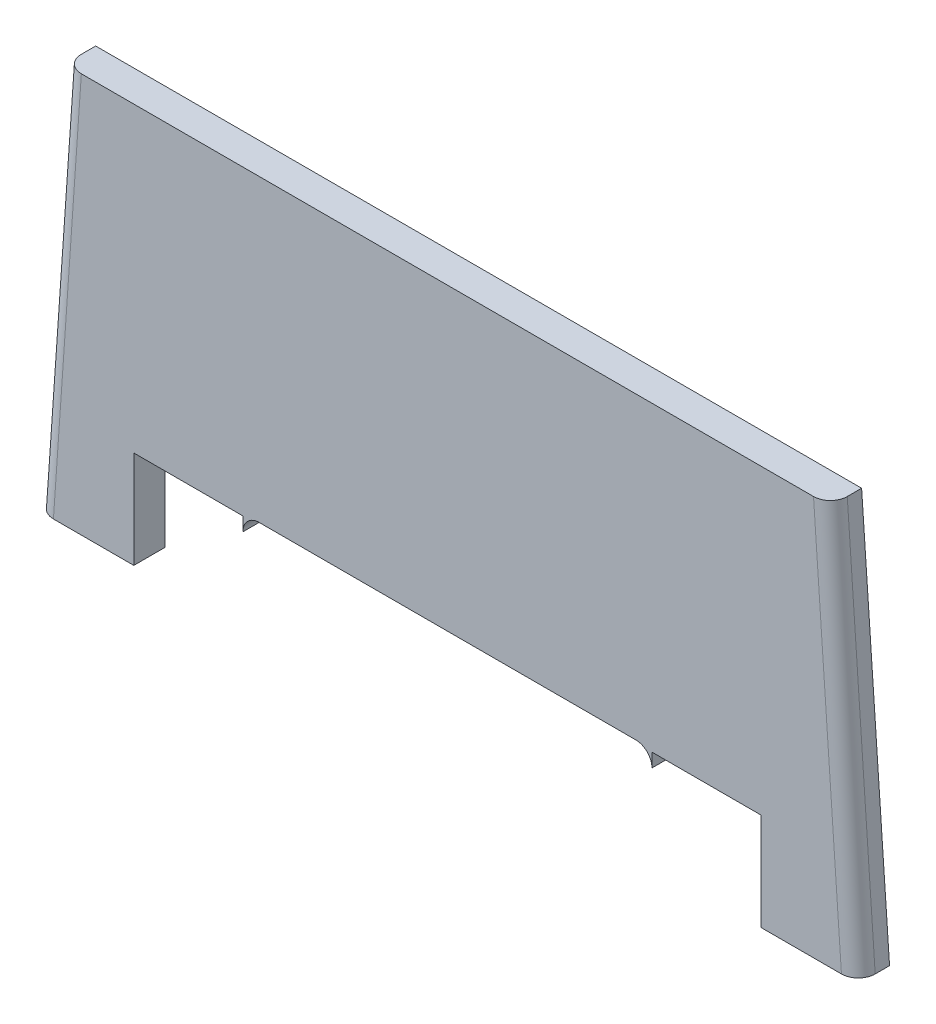
ISO-10303-21;
HEADER;
FILE_DESCRIPTION(('STEP AP214'),'2;1');
FILE_NAME('part.step','',(''),(''),'','','');
FILE_SCHEMA(('AUTOMOTIVE_DESIGN { 1 0 10303 214 1 1 1 1 }'));
ENDSEC;
DATA;
#1=APPLICATION_CONTEXT('core data for automotive mechanical design processes');
#2=APPLICATION_PROTOCOL_DEFINITION('international standard','automotive_design',2000,#1);
#3=PRODUCT_CONTEXT('',#1,'mechanical');
#4=PRODUCT('Part','Part','',(#3));
#5=PRODUCT_RELATED_PRODUCT_CATEGORY('part','',(#4));
#6=PRODUCT_DEFINITION_FORMATION('','',#4);
#7=PRODUCT_DEFINITION_CONTEXT('part definition',#1,'design');
#8=PRODUCT_DEFINITION('design','',#6,#7);
#9=PRODUCT_DEFINITION_SHAPE('','',#8);
#10=(LENGTH_UNIT() NAMED_UNIT(*) SI_UNIT(.MILLI.,.METRE.));
#11=(NAMED_UNIT(*) PLANE_ANGLE_UNIT() SI_UNIT($,.RADIAN.));
#12=(NAMED_UNIT(*) SI_UNIT($,.STERADIAN.) SOLID_ANGLE_UNIT());
#13=UNCERTAINTY_MEASURE_WITH_UNIT(LENGTH_MEASURE(1.E-05),#10,'distance_accuracy_value','');
#14=(GEOMETRIC_REPRESENTATION_CONTEXT(3) GLOBAL_UNCERTAINTY_ASSIGNED_CONTEXT((#13)) GLOBAL_UNIT_ASSIGNED_CONTEXT((#10,
#11,#12)) REPRESENTATION_CONTEXT('',''));
#15=CARTESIAN_POINT('',(0.,0.,0.));
#16=DIRECTION('',(0.,0.,1.));
#17=DIRECTION('',(1.,0.,0.));
#18=AXIS2_PLACEMENT_3D('',#15,#16,#17);
#19=CARTESIAN_POINT('',(-251.2,-80.,25.));
#20=DIRECTION('',(0.,-1.,0.));
#21=DIRECTION('',(1.,0.,0.));
#22=AXIS2_PLACEMENT_3D('',#19,#20,#21);
#23=PLANE('',#22);
#24=DIRECTION('',(-1.,0.,0.));
#25=VECTOR('',#24,1.);
#26=CARTESIAN_POINT('',(-251.2,-80.,25.));
#27=LINE('',#26,#25);
#28=CARTESIAN_POINT('',(-251.2,-80.,25.));
#29=VERTEX_POINT('',#28);
#30=CARTESIAN_POINT('',(-315.567034375904,-80.,25.));
#31=VERTEX_POINT('',#30);
#32=EDGE_CURVE('E188',#29,#31,#27,.T.);
#33=ORIENTED_EDGE('',*,*,#32,.T.);
#34=CARTESIAN_POINT('',(-315.567034375904,-80.,11.5));
#35=DIRECTION('',(0.,-1.,0.));
#36=DIRECTION('',(1.,0.,0.));
#37=AXIS2_PLACEMENT_3D('',#34,#35,#36);
#38=ELLIPSE('',#37,13.5329656240958,13.5);
#39=CARTESIAN_POINT('',(-329.1,-80.,11.5));
#40=VERTEX_POINT('',#39);
#41=EDGE_CURVE('E11',#31,#40,#38,.T.);
#42=ORIENTED_EDGE('',*,*,#41,.T.);
#43=DIRECTION('',(0.,0.,-1.));
#44=VECTOR('',#43,1.);
#45=CARTESIAN_POINT('',(-329.1,-80.,25.));
#46=LINE('',#45,#44);
#47=CARTESIAN_POINT('',(-329.1,-80.,0.));
#48=VERTEX_POINT('',#47);
#49=EDGE_CURVE('E219',#40,#48,#46,.T.);
#50=ORIENTED_EDGE('',*,*,#49,.T.);
#51=DIRECTION('',(-1.,0.,0.));
#52=VECTOR('',#51,1.);
#53=CARTESIAN_POINT('',(-251.2,-80.,0.));
#54=LINE('',#53,#52);
#55=CARTESIAN_POINT('',(-251.2,-80.,0.));
#56=VERTEX_POINT('',#55);
#57=EDGE_CURVE('E220',#56,#48,#54,.T.);
#58=ORIENTED_EDGE('',*,*,#57,.F.);
#59=DIRECTION('',(0.,0.,-1.));
#60=VECTOR('',#59,1.);
#61=CARTESIAN_POINT('',(-251.2,-80.,25.));
#62=LINE('',#61,#60);
#63=EDGE_CURVE('E270',#29,#56,#62,.T.);
#64=ORIENTED_EDGE('',*,*,#63,.F.);
#65=EDGE_LOOP('',(#33,#42,#50,#58,#64));
#66=FACE_BOUND('',#65,.T.);
#67=ADVANCED_FACE('F39',(#66),#23,.T.);
#68=CARTESIAN_POINT('',(-251.2,-2.,25.));
#69=DIRECTION('',(1.,0.,0.));
#70=DIRECTION('',(0.,0.,-1.));
#71=AXIS2_PLACEMENT_3D('',#68,#69,#70);
#72=PLANE('',#71);
#73=DIRECTION('',(0.,-1.,0.));
#74=VECTOR('',#73,1.);
#75=CARTESIAN_POINT('',(-251.2,-2.,0.));
#76=LINE('',#75,#74);
#77=CARTESIAN_POINT('',(-251.2,-2.,0.));
#78=VERTEX_POINT('',#77);
#79=EDGE_CURVE('E266',#78,#56,#76,.T.);
#80=ORIENTED_EDGE('',*,*,#79,.F.);
#81=DIRECTION('',(0.,0.,-1.));
#82=VECTOR('',#81,1.);
#83=CARTESIAN_POINT('',(-251.2,-2.,25.));
#84=LINE('',#83,#82);
#85=CARTESIAN_POINT('',(-251.2,-2.,25.));
#86=VERTEX_POINT('',#85);
#87=EDGE_CURVE('E274',#86,#78,#84,.T.);
#88=ORIENTED_EDGE('',*,*,#87,.F.);
#89=DIRECTION('',(0.,-1.,0.));
#90=VECTOR('',#89,1.);
#91=CARTESIAN_POINT('',(-251.2,-2.,25.));
#92=LINE('',#91,#90);
#93=EDGE_CURVE('E215',#86,#29,#92,.T.);
#94=ORIENTED_EDGE('',*,*,#93,.T.);
#95=ORIENTED_EDGE('',*,*,#63,.T.);
#96=EDGE_LOOP('',(#80,#88,#94,#95));
#97=FACE_BOUND('',#96,.T.);
#98=ADVANCED_FACE('F346',(#97),#72,.T.);
#99=CARTESIAN_POINT('',(-163.8,-1.99999999999999,25.));
#100=DIRECTION('',(0.,-1.,0.));
#101=DIRECTION('',(1.,0.,0.));
#102=AXIS2_PLACEMENT_3D('',#99,#100,#101);
#103=PLANE('',#102);
#104=DIRECTION('',(-1.,0.,0.));
#105=VECTOR('',#104,1.);
#106=CARTESIAN_POINT('',(-163.8,-1.99999999999999,0.));
#107=LINE('',#106,#105);
#108=CARTESIAN_POINT('',(-163.8,-1.99999999999999,0.));
#109=VERTEX_POINT('',#108);
#110=EDGE_CURVE('E262',#109,#78,#107,.T.);
#111=ORIENTED_EDGE('',*,*,#110,.F.);
#112=DIRECTION('',(0.,0.,-1.));
#113=VECTOR('',#112,1.);
#114=CARTESIAN_POINT('',(-163.8,-1.99999999999999,25.));
#115=LINE('',#114,#113);
#116=CARTESIAN_POINT('',(-163.8,-1.99999999999999,25.));
#117=VERTEX_POINT('',#116);
#118=EDGE_CURVE('E277',#117,#109,#115,.T.);
#119=ORIENTED_EDGE('',*,*,#118,.F.);
#120=DIRECTION('',(-1.,0.,0.));
#121=VECTOR('',#120,1.);
#122=CARTESIAN_POINT('',(-163.8,-1.99999999999999,25.));
#123=LINE('',#122,#121);
#124=EDGE_CURVE('E211',#117,#86,#123,.T.);
#125=ORIENTED_EDGE('',*,*,#124,.T.);
#126=ORIENTED_EDGE('',*,*,#87,.T.);
#127=EDGE_LOOP('',(#111,#119,#125,#126));
#128=FACE_BOUND('',#127,.T.);
#129=ADVANCED_FACE('F349',(#128),#103,.T.);
#130=CARTESIAN_POINT('',(-163.8,-1.99999999999999,25.));
#131=DIRECTION('',(1.,0.,0.));
#132=DIRECTION('',(0.,1.,0.));
#133=AXIS2_PLACEMENT_3D('',#130,#131,#132);
#134=PLANE('',#133);
#135=DIRECTION('',(0.,-1.,0.));
#136=VECTOR('',#135,1.);
#137=CARTESIAN_POINT('',(-163.8,-1.99999999999999,0.));
#138=LINE('',#137,#136);
#139=CARTESIAN_POINT('',(-163.8,-13.,0.));
#140=VERTEX_POINT('',#139);
#141=EDGE_CURVE('E259',#109,#140,#138,.T.);
#142=ORIENTED_EDGE('',*,*,#141,.T.);
#143=DIRECTION('',(0.,0.,-1.));
#144=VECTOR('',#143,1.);
#145=CARTESIAN_POINT('',(-163.8,-13.,25.));
#146=LINE('',#145,#144);
#147=CARTESIAN_POINT('',(-163.8,-13.,25.));
#148=VERTEX_POINT('',#147);
#149=EDGE_CURVE('E280',#148,#140,#146,.T.);
#150=ORIENTED_EDGE('',*,*,#149,.F.);
#151=DIRECTION('',(0.,-1.,0.));
#152=VECTOR('',#151,1.);
#153=CARTESIAN_POINT('',(-163.8,-1.99999999999999,25.));
#154=LINE('',#153,#152);
#155=EDGE_CURVE('E208',#117,#148,#154,.T.);
#156=ORIENTED_EDGE('',*,*,#155,.F.);
#157=ORIENTED_EDGE('',*,*,#118,.T.);
#158=EDGE_LOOP('',(#142,#150,#156,#157));
#159=FACE_BOUND('',#158,.T.);
#160=ADVANCED_FACE('F355',(#159),#134,.F.);
#161=CARTESIAN_POINT('',(-150.8,-13.,25.));
#162=DIRECTION('',(0.,0.,-1.));
#163=DIRECTION('',(-1.,0.,0.));
#164=AXIS2_PLACEMENT_3D('',#161,#162,#163);
#165=CYLINDRICAL_SURFACE('',#164,13.);
#166=CARTESIAN_POINT('',(-150.8,-13.,0.));
#167=DIRECTION('',(0.,0.,-1.));
#168=DIRECTION('',(-1.,0.,0.));
#169=AXIS2_PLACEMENT_3D('',#166,#167,#168);
#170=CIRCLE('',#169,13.);
#171=CARTESIAN_POINT('',(-150.8,0.,0.));
#172=VERTEX_POINT('',#171);
#173=EDGE_CURVE('E256',#140,#172,#170,.T.);
#174=ORIENTED_EDGE('',*,*,#173,.T.);
#175=DIRECTION('',(0.,0.,-1.));
#176=VECTOR('',#175,1.);
#177=CARTESIAN_POINT('',(-150.8,0.,25.));
#178=LINE('',#177,#176);
#179=CARTESIAN_POINT('',(-150.8,0.,25.));
#180=VERTEX_POINT('',#179);
#181=EDGE_CURVE('E284',#180,#172,#178,.T.);
#182=ORIENTED_EDGE('',*,*,#181,.F.);
#183=CARTESIAN_POINT('',(-150.8,-13.,25.));
#184=DIRECTION('',(0.,0.,-1.));
#185=DIRECTION('',(-1.,0.,0.));
#186=AXIS2_PLACEMENT_3D('',#183,#184,#185);
#187=CIRCLE('',#186,13.);
#188=EDGE_CURVE('E205',#148,#180,#187,.T.);
#189=ORIENTED_EDGE('',*,*,#188,.F.);
#190=ORIENTED_EDGE('',*,*,#149,.T.);
#191=EDGE_LOOP('',(#174,#182,#189,#190));
#192=FACE_BOUND('',#191,.T.);
#193=ADVANCED_FACE('F359',(#192),#165,.F.);
#194=CARTESIAN_POINT('',(-150.8,0.,25.));
#195=DIRECTION('',(0.,1.,0.));
#196=DIRECTION('',(-1.,0.,0.));
#197=AXIS2_PLACEMENT_3D('',#194,#195,#196);
#198=PLANE('',#197);
#199=DIRECTION('',(1.,0.,0.));
#200=VECTOR('',#199,1.);
#201=CARTESIAN_POINT('',(-150.8,0.,0.));
#202=LINE('',#201,#200);
#203=CARTESIAN_POINT('',(150.8,0.,0.));
#204=VERTEX_POINT('',#203);
#205=EDGE_CURVE('E252',#172,#204,#202,.T.);
#206=ORIENTED_EDGE('',*,*,#205,.T.);
#207=DIRECTION('',(0.,0.,-1.));
#208=VECTOR('',#207,1.);
#209=CARTESIAN_POINT('',(150.8,0.,25.));
#210=LINE('',#209,#208);
#211=CARTESIAN_POINT('',(150.8,0.,25.));
#212=VERTEX_POINT('',#211);
#213=EDGE_CURVE('E288',#212,#204,#210,.T.);
#214=ORIENTED_EDGE('',*,*,#213,.F.);
#215=DIRECTION('',(1.,0.,0.));
#216=VECTOR('',#215,1.);
#217=CARTESIAN_POINT('',(-150.8,0.,25.));
#218=LINE('',#217,#216);
#219=EDGE_CURVE('E202',#180,#212,#218,.T.);
#220=ORIENTED_EDGE('',*,*,#219,.F.);
#221=ORIENTED_EDGE('',*,*,#181,.T.);
#222=EDGE_LOOP('',(#206,#214,#220,#221));
#223=FACE_BOUND('',#222,.T.);
#224=ADVANCED_FACE('F364',(#223),#198,.F.);
#225=CARTESIAN_POINT('',(150.8,-13.,25.));
#226=DIRECTION('',(0.,0.,-1.));
#227=DIRECTION('',(-1.,0.,0.));
#228=AXIS2_PLACEMENT_3D('',#225,#226,#227);
#229=CYLINDRICAL_SURFACE('',#228,13.);
#230=CARTESIAN_POINT('',(150.8,-13.,0.));
#231=DIRECTION('',(0.,0.,1.));
#232=DIRECTION('',(1.,0.,0.));
#233=AXIS2_PLACEMENT_3D('',#230,#231,#232);
#234=CIRCLE('',#233,13.);
#235=CARTESIAN_POINT('',(163.8,-13.,0.));
#236=VERTEX_POINT('',#235);
#237=EDGE_CURVE('E248',#236,#204,#234,.T.);
#238=ORIENTED_EDGE('',*,*,#237,.F.);
#239=DIRECTION('',(0.,0.,-1.));
#240=VECTOR('',#239,1.);
#241=CARTESIAN_POINT('',(163.8,-13.,25.));
#242=LINE('',#241,#240);
#243=CARTESIAN_POINT('',(163.8,-13.,25.));
#244=VERTEX_POINT('',#243);
#245=EDGE_CURVE('E291',#244,#236,#242,.T.);
#246=ORIENTED_EDGE('',*,*,#245,.F.);
#247=CARTESIAN_POINT('',(150.8,-13.,25.));
#248=DIRECTION('',(0.,0.,1.));
#249=DIRECTION('',(1.,0.,0.));
#250=AXIS2_PLACEMENT_3D('',#247,#248,#249);
#251=CIRCLE('',#250,13.);
#252=EDGE_CURVE('E198',#244,#212,#251,.T.);
#253=ORIENTED_EDGE('',*,*,#252,.T.);
#254=ORIENTED_EDGE('',*,*,#213,.T.);
#255=EDGE_LOOP('',(#238,#246,#253,#254));
#256=FACE_BOUND('',#255,.T.);
#257=ADVANCED_FACE('F411',(#256),#229,.F.);
#258=CARTESIAN_POINT('',(163.8,-1.99999999999995,25.));
#259=DIRECTION('',(1.,0.,0.));
#260=DIRECTION('',(0.,1.,0.));
#261=AXIS2_PLACEMENT_3D('',#258,#259,#260);
#262=PLANE('',#261);
#263=DIRECTION('',(0.,-1.,0.));
#264=VECTOR('',#263,1.);
#265=CARTESIAN_POINT('',(163.8,-1.99999999999995,0.));
#266=LINE('',#265,#264);
#267=CARTESIAN_POINT('',(163.8,-1.99999999999995,0.));
#268=VERTEX_POINT('',#267);
#269=EDGE_CURVE('E244',#268,#236,#266,.T.);
#270=ORIENTED_EDGE('',*,*,#269,.F.);
#271=DIRECTION('',(0.,0.,-1.));
#272=VECTOR('',#271,1.);
#273=CARTESIAN_POINT('',(163.8,-1.99999999999995,25.));
#274=LINE('',#273,#272);
#275=CARTESIAN_POINT('',(163.8,-1.99999999999995,25.));
#276=VERTEX_POINT('',#275);
#277=EDGE_CURVE('E294',#276,#268,#274,.T.);
#278=ORIENTED_EDGE('',*,*,#277,.F.);
#279=DIRECTION('',(0.,-1.,0.));
#280=VECTOR('',#279,1.);
#281=CARTESIAN_POINT('',(163.8,-1.99999999999995,25.));
#282=LINE('',#281,#280);
#283=EDGE_CURVE('E194',#276,#244,#282,.T.);
#284=ORIENTED_EDGE('',*,*,#283,.T.);
#285=ORIENTED_EDGE('',*,*,#245,.T.);
#286=EDGE_LOOP('',(#270,#278,#284,#285));
#287=FACE_BOUND('',#286,.T.);
#288=ADVANCED_FACE('F369',(#287),#262,.T.);
#289=CARTESIAN_POINT('',(163.8,-1.99999999999995,25.));
#290=DIRECTION('',(0.,1.,0.));
#291=DIRECTION('',(-1.,0.,0.));
#292=AXIS2_PLACEMENT_3D('',#289,#290,#291);
#293=PLANE('',#292);
#294=DIRECTION('',(1.,0.,0.));
#295=VECTOR('',#294,1.);
#296=CARTESIAN_POINT('',(163.8,-1.99999999999995,0.));
#297=LINE('',#296,#295);
#298=CARTESIAN_POINT('',(251.2,-1.99999999999994,0.));
#299=VERTEX_POINT('',#298);
#300=EDGE_CURVE('E241',#268,#299,#297,.T.);
#301=ORIENTED_EDGE('',*,*,#300,.T.);
#302=DIRECTION('',(0.,0.,-1.));
#303=VECTOR('',#302,1.);
#304=CARTESIAN_POINT('',(251.2,-1.99999999999994,25.));
#305=LINE('',#304,#303);
#306=CARTESIAN_POINT('',(251.2,-1.99999999999994,25.));
#307=VERTEX_POINT('',#306);
#308=EDGE_CURVE('E177',#307,#299,#305,.T.);
#309=ORIENTED_EDGE('',*,*,#308,.F.);
#310=DIRECTION('',(1.,0.,0.));
#311=VECTOR('',#310,1.);
#312=CARTESIAN_POINT('',(163.8,-1.99999999999995,25.));
#313=LINE('',#312,#311);
#314=EDGE_CURVE('E162',#276,#307,#313,.T.);
#315=ORIENTED_EDGE('',*,*,#314,.F.);
#316=ORIENTED_EDGE('',*,*,#277,.T.);
#317=EDGE_LOOP('',(#301,#309,#315,#316));
#318=FACE_BOUND('',#317,.T.);
#319=ADVANCED_FACE('F373',(#318),#293,.F.);
#320=CARTESIAN_POINT('',(251.2,-1.99999999999994,25.));
#321=DIRECTION('',(1.,0.,0.));
#322=DIRECTION('',(0.,1.,0.));
#323=AXIS2_PLACEMENT_3D('',#320,#321,#322);
#324=PLANE('',#323);
#325=DIRECTION('',(0.,-1.,0.));
#326=VECTOR('',#325,1.);
#327=CARTESIAN_POINT('',(251.2,-1.99999999999994,0.));
#328=LINE('',#327,#326);
#329=CARTESIAN_POINT('',(251.2,-79.9999999999999,0.));
#330=VERTEX_POINT('',#329);
#331=EDGE_CURVE('E172',#299,#330,#328,.T.);
#332=ORIENTED_EDGE('',*,*,#331,.T.);
#333=DIRECTION('',(0.,0.,-1.));
#334=VECTOR('',#333,1.);
#335=CARTESIAN_POINT('',(251.2,-79.9999999999999,25.));
#336=LINE('',#335,#334);
#337=CARTESIAN_POINT('',(251.2,-79.9999999999999,25.));
#338=VERTEX_POINT('',#337);
#339=EDGE_CURVE('E169',#338,#330,#336,.T.);
#340=ORIENTED_EDGE('',*,*,#339,.F.);
#341=DIRECTION('',(0.,-1.,0.));
#342=VECTOR('',#341,1.);
#343=CARTESIAN_POINT('',(251.2,-1.99999999999994,25.));
#344=LINE('',#343,#342);
#345=EDGE_CURVE('E153',#307,#338,#344,.T.);
#346=ORIENTED_EDGE('',*,*,#345,.F.);
#347=ORIENTED_EDGE('',*,*,#308,.T.);
#348=EDGE_LOOP('',(#332,#340,#346,#347));
#349=FACE_BOUND('',#348,.T.);
#350=ADVANCED_FACE('F170',(#349),#324,.F.);
#351=CARTESIAN_POINT('',(251.2,-79.9999999999999,25.));
#352=DIRECTION('',(0.,1.,0.));
#353=DIRECTION('',(-1.,0.,0.));
#354=AXIS2_PLACEMENT_3D('',#351,#352,#353);
#355=PLANE('',#354);
#356=DIRECTION('',(0.,0.,-1.));
#357=VECTOR('',#356,1.);
#358=CARTESIAN_POINT('',(329.1,-79.9999999999999,25.));
#359=LINE('',#358,#357);
#360=CARTESIAN_POINT('',(329.1,-79.9999999999999,11.5));
#361=VERTEX_POINT('',#360);
#362=CARTESIAN_POINT('',(329.1,-79.9999999999999,0.));
#363=VERTEX_POINT('',#362);
#364=EDGE_CURVE('E178',#361,#363,#359,.T.);
#365=ORIENTED_EDGE('',*,*,#364,.F.);
#366=CARTESIAN_POINT('',(315.567034375904,-79.9999999999999,11.5));
#367=DIRECTION('',(0.,1.,0.));
#368=DIRECTION('',(1.,0.,0.));
#369=AXIS2_PLACEMENT_3D('',#366,#367,#368);
#370=ELLIPSE('',#369,13.5329656240958,13.5);
#371=CARTESIAN_POINT('',(315.567034375904,-79.9999999999999,25.));
#372=VERTEX_POINT('',#371);
#373=EDGE_CURVE('E182',#361,#372,#370,.F.);
#374=ORIENTED_EDGE('',*,*,#373,.T.);
#375=DIRECTION('',(1.,0.,0.));
#376=VECTOR('',#375,1.);
#377=CARTESIAN_POINT('',(251.2,-79.9999999999999,25.));
#378=LINE('',#377,#376);
#379=EDGE_CURVE('E158',#338,#372,#378,.T.);
#380=ORIENTED_EDGE('',*,*,#379,.F.);
#381=ORIENTED_EDGE('',*,*,#339,.T.);
#382=DIRECTION('',(1.,0.,0.));
#383=VECTOR('',#382,1.);
#384=CARTESIAN_POINT('',(251.2,-79.9999999999999,0.));
#385=LINE('',#384,#383);
#386=EDGE_CURVE('E236',#330,#363,#385,.T.);
#387=ORIENTED_EDGE('',*,*,#386,.T.);
#388=EDGE_LOOP('',(#365,#374,#380,#381,#387));
#389=FACE_BOUND('',#388,.T.);
#390=ADVANCED_FACE('F180',(#389),#355,.F.);
#391=CARTESIAN_POINT('',(329.1,-79.9999999999999,25.));
#392=DIRECTION('',(-0.997564050259824,-0.069756473744129,0.));
#393=DIRECTION('',(0.069756473744129,-0.997564050259824,0.));
#394=AXIS2_PLACEMENT_3D('',#391,#392,#393);
#395=PLANE('',#394);
#396=DIRECTION('',(0.,0.,-1.));
#397=VECTOR('',#396,1.);
#398=CARTESIAN_POINT('',(306.723420178076,240.,25.));
#399=LINE('',#398,#397);
#400=CARTESIAN_POINT('',(306.723420178076,240.,11.5));
#401=VERTEX_POINT('',#400);
#402=CARTESIAN_POINT('',(306.723420178076,240.,0.));
#403=VERTEX_POINT('',#402);
#404=EDGE_CURVE('E301',#401,#403,#399,.T.);
#405=ORIENTED_EDGE('',*,*,#404,.F.);
#406=DIRECTION('',(-0.069756473744129,0.997564050259824,0.));
#407=VECTOR('',#406,1.);
#408=CARTESIAN_POINT('',(329.1,-79.9999999999999,11.5));
#409=LINE('',#408,#407);
#410=EDGE_CURVE('E61',#401,#361,#409,.F.);
#411=ORIENTED_EDGE('',*,*,#410,.T.);
#412=ORIENTED_EDGE('',*,*,#364,.T.);
#413=DIRECTION('',(-0.069756473744129,0.997564050259824,0.));
#414=VECTOR('',#413,1.);
#415=CARTESIAN_POINT('',(329.1,-79.9999999999999,0.));
#416=LINE('',#415,#414);
#417=EDGE_CURVE('E232',#363,#403,#416,.T.);
#418=ORIENTED_EDGE('',*,*,#417,.T.);
#419=EDGE_LOOP('',(#405,#411,#412,#418));
#420=FACE_BOUND('',#419,.T.);
#421=ADVANCED_FACE('F376',(#420),#395,.F.);
#422=CARTESIAN_POINT('',(-306.723420178076,240.,25.));
#423=DIRECTION('',(0.,1.,0.));
#424=DIRECTION('',(-1.,0.,0.));
#425=AXIS2_PLACEMENT_3D('',#422,#423,#424);
#426=PLANE('',#425);
#427=DIRECTION('',(1.,0.,0.));
#428=VECTOR('',#427,1.);
#429=CARTESIAN_POINT('',(-306.723420178076,240.,25.));
#430=LINE('',#429,#428);
#431=CARTESIAN_POINT('',(-293.19045455398,240.,25.));
#432=VERTEX_POINT('',#431);
#433=CARTESIAN_POINT('',(293.19045455398,240.,25.));
#434=VERTEX_POINT('',#433);
#435=EDGE_CURVE('E184',#432,#434,#430,.T.);
#436=ORIENTED_EDGE('',*,*,#435,.T.);
#437=CARTESIAN_POINT('',(293.19045455398,240.,11.5));
#438=DIRECTION('',(0.,1.,0.));
#439=DIRECTION('',(1.,0.,0.));
#440=AXIS2_PLACEMENT_3D('',#437,#438,#439);
#441=ELLIPSE('',#440,13.5329656240958,13.5);
#442=EDGE_CURVE('E317',#434,#401,#441,.T.);
#443=ORIENTED_EDGE('',*,*,#442,.T.);
#444=ORIENTED_EDGE('',*,*,#404,.T.);
#445=DIRECTION('',(1.,0.,0.));
#446=VECTOR('',#445,1.);
#447=CARTESIAN_POINT('',(-306.723420178076,240.,0.));
#448=LINE('',#447,#446);
#449=CARTESIAN_POINT('',(-306.723420178076,240.,0.));
#450=VERTEX_POINT('',#449);
#451=EDGE_CURVE('E228',#450,#403,#448,.T.);
#452=ORIENTED_EDGE('',*,*,#451,.F.);
#453=DIRECTION('',(0.,0.,-1.));
#454=VECTOR('',#453,1.);
#455=CARTESIAN_POINT('',(-306.723420178076,240.,25.));
#456=LINE('',#455,#454);
#457=CARTESIAN_POINT('',(-306.723420178076,240.,11.5));
#458=VERTEX_POINT('',#457);
#459=EDGE_CURVE('E304',#458,#450,#456,.T.);
#460=ORIENTED_EDGE('',*,*,#459,.F.);
#461=CARTESIAN_POINT('',(-293.19045455398,240.,11.5));
#462=DIRECTION('',(0.,1.,0.));
#463=DIRECTION('',(1.,0.,0.));
#464=AXIS2_PLACEMENT_3D('',#461,#462,#463);
#465=ELLIPSE('',#464,13.5329656240958,13.5);
#466=EDGE_CURVE('E314',#458,#432,#465,.T.);
#467=ORIENTED_EDGE('',*,*,#466,.T.);
#468=EDGE_LOOP('',(#436,#443,#444,#452,#460,#467));
#469=FACE_BOUND('',#468,.T.);
#470=ADVANCED_FACE('F333',(#469),#426,.T.);
#471=CARTESIAN_POINT('',(-329.1,-80.,25.));
#472=DIRECTION('',(-0.997564050259824,0.0697564737441287,0.));
#473=DIRECTION('',(-0.0697564737441287,-0.997564050259824,0.));
#474=AXIS2_PLACEMENT_3D('',#471,#472,#473);
#475=PLANE('',#474);
#476=ORIENTED_EDGE('',*,*,#49,.F.);
#477=DIRECTION('',(0.0697564737441287,0.997564050259824,0.));
#478=VECTOR('',#477,1.);
#479=CARTESIAN_POINT('',(-329.1,-80.,11.5));
#480=LINE('',#479,#478);
#481=EDGE_CURVE('E48',#40,#458,#480,.T.);
#482=ORIENTED_EDGE('',*,*,#481,.T.);
#483=ORIENTED_EDGE('',*,*,#459,.T.);
#484=DIRECTION('',(0.0697564737441287,0.997564050259824,0.));
#485=VECTOR('',#484,1.);
#486=CARTESIAN_POINT('',(-329.1,-80.,0.));
#487=LINE('',#486,#485);
#488=EDGE_CURVE('E224',#48,#450,#487,.T.);
#489=ORIENTED_EDGE('',*,*,#488,.F.);
#490=EDGE_LOOP('',(#476,#482,#483,#489));
#491=FACE_BOUND('',#490,.T.);
#492=ADVANCED_FACE('F328',(#491),#475,.T.);
#493=CARTESIAN_POINT('',(150.8,-13.,25.));
#494=DIRECTION('',(0.,0.,1.));
#495=DIRECTION('',(1.,0.,0.));
#496=AXIS2_PLACEMENT_3D('',#493,#494,#495);
#497=PLANE('',#496);
#498=ORIENTED_EDGE('',*,*,#379,.T.);
#499=DIRECTION('',(-0.069756473744129,0.997564050259824,0.));
#500=VECTOR('',#499,1.);
#501=CARTESIAN_POINT('',(293.256305499568,239.058287604454,25.));
#502=LINE('',#501,#500);
#503=EDGE_CURVE('E311',#372,#434,#502,.T.);
#504=ORIENTED_EDGE('',*,*,#503,.T.);
#505=ORIENTED_EDGE('',*,*,#435,.F.);
#506=DIRECTION('',(0.0697564737441287,0.997564050259824,0.));
#507=VECTOR('',#506,1.);
#508=CARTESIAN_POINT('',(-308.635409533869,19.1268534826662,25.));
#509=LINE('',#508,#507);
#510=EDGE_CURVE('E273',#432,#31,#509,.F.);
#511=ORIENTED_EDGE('',*,*,#510,.T.);
#512=ORIENTED_EDGE('',*,*,#32,.F.);
#513=ORIENTED_EDGE('',*,*,#93,.F.);
#514=ORIENTED_EDGE('',*,*,#124,.F.);
#515=ORIENTED_EDGE('',*,*,#155,.T.);
#516=ORIENTED_EDGE('',*,*,#188,.T.);
#517=ORIENTED_EDGE('',*,*,#219,.T.);
#518=ORIENTED_EDGE('',*,*,#252,.F.);
#519=ORIENTED_EDGE('',*,*,#283,.F.);
#520=ORIENTED_EDGE('',*,*,#314,.T.);
#521=ORIENTED_EDGE('',*,*,#345,.T.);
#522=EDGE_LOOP('',(#498,#504,#505,#511,#512,#513,#514,#515,#516,#517,#518,#519,#520,#521));
#523=FACE_BOUND('',#522,.T.);
#524=ADVANCED_FACE('F155',(#523),#497,.T.);
#525=CARTESIAN_POINT('',(150.8,-13.,0.));
#526=DIRECTION('',(0.,0.,1.));
#527=DIRECTION('',(1.,0.,0.));
#528=AXIS2_PLACEMENT_3D('',#525,#526,#527);
#529=PLANE('',#528);
#530=ORIENTED_EDGE('',*,*,#57,.T.);
#531=ORIENTED_EDGE('',*,*,#488,.T.);
#532=ORIENTED_EDGE('',*,*,#451,.T.);
#533=ORIENTED_EDGE('',*,*,#417,.F.);
#534=ORIENTED_EDGE('',*,*,#386,.F.);
#535=ORIENTED_EDGE('',*,*,#331,.F.);
#536=ORIENTED_EDGE('',*,*,#300,.F.);
#537=ORIENTED_EDGE('',*,*,#269,.T.);
#538=ORIENTED_EDGE('',*,*,#237,.T.);
#539=ORIENTED_EDGE('',*,*,#205,.F.);
#540=ORIENTED_EDGE('',*,*,#173,.F.);
#541=ORIENTED_EDGE('',*,*,#141,.F.);
#542=ORIENTED_EDGE('',*,*,#110,.T.);
#543=ORIENTED_EDGE('',*,*,#79,.T.);
#544=EDGE_LOOP('',(#530,#531,#532,#533,#534,#535,#536,#537,#538,#539,#540,#541,#542,#543));
#545=FACE_BOUND('',#544,.T.);
#546=ADVANCED_FACE('F337',(#545),#529,.F.);
#547=CARTESIAN_POINT('',(310.102984767641,-1.86045014211264,11.5));
#548=DIRECTION('',(0.069756473744129,-0.997564050259824,0.));
#549=DIRECTION('',(0.997564050259824,0.069756473744129,0.));
#550=AXIS2_PLACEMENT_3D('',#547,#548,#549);
#551=CYLINDRICAL_SURFACE('',#550,13.5);
#552=ORIENTED_EDGE('',*,*,#373,.F.);
#553=ORIENTED_EDGE('',*,*,#410,.F.);
#554=ORIENTED_EDGE('',*,*,#442,.F.);
#555=ORIENTED_EDGE('',*,*,#503,.F.);
#556=EDGE_LOOP('',(#552,#553,#554,#555));
#557=FACE_BOUND('',#556,.T.);
#558=ADVANCED_FACE('F375',(#557),#551,.T.);
#559=CARTESIAN_POINT('',(-315.632885321492,-80.9417123955457,11.5));
#560=DIRECTION('',(0.0697564737441287,0.997564050259824,0.));
#561=DIRECTION('',(-0.997564050259824,0.0697564737441287,0.));
#562=AXIS2_PLACEMENT_3D('',#559,#560,#561);
#563=CYLINDRICAL_SURFACE('',#562,13.5);
#564=ORIENTED_EDGE('',*,*,#41,.F.);
#565=ORIENTED_EDGE('',*,*,#510,.F.);
#566=ORIENTED_EDGE('',*,*,#466,.F.);
#567=ORIENTED_EDGE('',*,*,#481,.F.);
#568=EDGE_LOOP('',(#564,#565,#566,#567));
#569=FACE_BOUND('',#568,.T.);
#570=ADVANCED_FACE('F41',(#569),#563,.T.);
#571=CLOSED_SHELL('',(#67,#98,#129,#160,#193,#224,#257,#288,#319,#350,#390,#421,#470,#492,#524,
#546,#558,#570));
#572=MANIFOLD_SOLID_BREP('B2',#571);
#573=ADVANCED_BREP_SHAPE_REPRESENTATION('',(#18,#572),#14);
#574=SHAPE_DEFINITION_REPRESENTATION(#9,#573);
ENDSEC;
END-ISO-10303-21;
